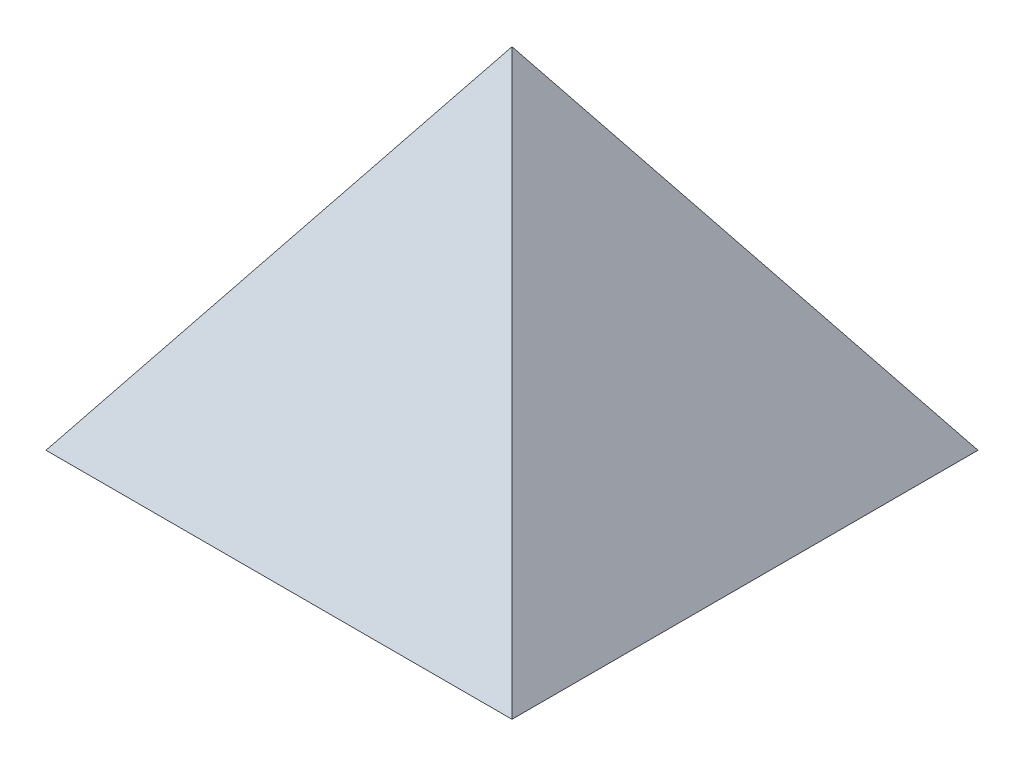
ISO-10303-21;
HEADER;
FILE_DESCRIPTION(('STEP AP214'),'2;1');
FILE_NAME('part.step','',(''),(''),'','','');
FILE_SCHEMA(('AUTOMOTIVE_DESIGN { 1 0 10303 214 1 1 1 1 }'));
ENDSEC;
DATA;
#1=APPLICATION_CONTEXT('core data for automotive mechanical design processes');
#2=APPLICATION_PROTOCOL_DEFINITION('international standard','automotive_design',2000,#1);
#3=PRODUCT_CONTEXT('',#1,'mechanical');
#4=PRODUCT('Part','Part','',(#3));
#5=PRODUCT_RELATED_PRODUCT_CATEGORY('part','',(#4));
#6=PRODUCT_DEFINITION_FORMATION('','',#4);
#7=PRODUCT_DEFINITION_CONTEXT('part definition',#1,'design');
#8=PRODUCT_DEFINITION('design','',#6,#7);
#9=PRODUCT_DEFINITION_SHAPE('','',#8);
#10=(LENGTH_UNIT() NAMED_UNIT(*) SI_UNIT(.MILLI.,.METRE.));
#11=(NAMED_UNIT(*) PLANE_ANGLE_UNIT() SI_UNIT($,.RADIAN.));
#12=(NAMED_UNIT(*) SI_UNIT($,.STERADIAN.) SOLID_ANGLE_UNIT());
#13=UNCERTAINTY_MEASURE_WITH_UNIT(LENGTH_MEASURE(1.E-05),#10,'distance_accuracy_value','');
#14=(GEOMETRIC_REPRESENTATION_CONTEXT(3) GLOBAL_UNCERTAINTY_ASSIGNED_CONTEXT((#13)) GLOBAL_UNIT_ASSIGNED_CONTEXT((#10,
#11,#12)) REPRESENTATION_CONTEXT('',''));
#15=CARTESIAN_POINT('',(0.,0.,0.));
#16=DIRECTION('',(0.,0.,1.));
#17=DIRECTION('',(1.,0.,0.));
#18=AXIS2_PLACEMENT_3D('',#15,#16,#17);
#19=CARTESIAN_POINT('',(0.,2.54,0.));
#20=DIRECTION('',(0.,-1.,0.));
#21=DIRECTION('',(0.,0.,-1.));
#22=AXIS2_PLACEMENT_3D('',#19,#20,#21);
#23=PLANE('',#22);
#24=DIRECTION('',(-1.,0.,0.));
#25=VECTOR('',#24,1.);
#26=CARTESIAN_POINT('',(0.,2.54,-46.0539665867738));
#27=LINE('',#26,#25);
#28=CARTESIAN_POINT('',(46.0539665867738,2.54,-46.0539665867738));
#29=VERTEX_POINT('',#28);
#30=CARTESIAN_POINT('',(-31.5228230502122,2.54000000000002,-46.0539665867738));
#31=VERTEX_POINT('',#30);
#32=EDGE_CURVE('E119',#29,#31,#27,.T.);
#33=ORIENTED_EDGE('',*,*,#32,.T.);
#34=CARTESIAN_POINT('',(-39.3939769497878,2.54000000000002,-46.0539665867738));
#35=VERTEX_POINT('',#34);
#36=EDGE_CURVE('E109',#31,#35,#27,.T.);
#37=ORIENTED_EDGE('',*,*,#36,.T.);
#38=CARTESIAN_POINT('',(-46.0539665867738,2.54,-46.0539665867738));
#39=VERTEX_POINT('',#38);
#40=EDGE_CURVE('E110',#35,#39,#27,.T.);
#41=ORIENTED_EDGE('',*,*,#40,.T.);
#42=DIRECTION('',(0.,0.,1.));
#43=VECTOR('',#42,1.);
#44=CARTESIAN_POINT('',(-46.0539665867738,2.54,0.));
#45=LINE('',#44,#43);
#46=CARTESIAN_POINT('',(-46.0539665867738,2.54,46.0539665867738));
#47=VERTEX_POINT('',#46);
#48=EDGE_CURVE('E123',#39,#47,#45,.T.);
#49=ORIENTED_EDGE('',*,*,#48,.T.);
#50=DIRECTION('',(1.,0.,0.));
#51=VECTOR('',#50,1.);
#52=CARTESIAN_POINT('',(0.,2.54,46.0539665867738));
#53=LINE('',#52,#51);
#54=CARTESIAN_POINT('',(46.0539665867738,2.54,46.0539665867738));
#55=VERTEX_POINT('',#54);
#56=EDGE_CURVE('E66',#47,#55,#53,.T.);
#57=ORIENTED_EDGE('',*,*,#56,.T.);
#58=DIRECTION('',(0.,0.,-1.));
#59=VECTOR('',#58,1.);
#60=CARTESIAN_POINT('',(46.0539665867738,2.54,0.));
#61=LINE('',#60,#59);
#62=EDGE_CURVE('E12',#55,#29,#61,.T.);
#63=ORIENTED_EDGE('',*,*,#62,.T.);
#64=EDGE_LOOP('',(#33,#37,#41,#49,#57,#63));
#65=FACE_BOUND('',#64,.T.);
#66=ADVANCED_FACE('F43',(#65),#23,.F.);
#67=CARTESIAN_POINT('',(33.0558230216126,22.0372153477418,0.));
#68=DIRECTION('',(0.832050294337844,0.554700196225229,0.));
#69=DIRECTION('',(-0.554700196225229,0.832050294337844,0.));
#70=AXIS2_PLACEMENT_3D('',#67,#68,#69);
#71=PLANE('',#70);
#72=ORIENTED_EDGE('',*,*,#62,.F.);
#73=DIRECTION('',(0.485071250072666,-0.727606875108999,0.485071250072666));
#74=VECTOR('',#73,1.);
#75=CARTESIAN_POINT('',(25.277982310645,33.7039764141933,25.277982310645));
#76=LINE('',#75,#74);
#77=CARTESIAN_POINT('',(0.,71.6209498801607,0.));
#78=VERTEX_POINT('',#77);
#79=EDGE_CURVE('E129',#78,#55,#76,.T.);
#80=ORIENTED_EDGE('',*,*,#79,.F.);
#81=DIRECTION('',(0.485071250072666,-0.727606875108999,-0.485071250072666));
#82=VECTOR('',#81,1.);
#83=CARTESIAN_POINT('',(25.277982310645,33.7039764141933,-25.277982310645));
#84=LINE('',#83,#82);
#85=EDGE_CURVE('E128',#78,#29,#84,.T.);
#86=ORIENTED_EDGE('',*,*,#85,.T.);
#87=EDGE_LOOP('',(#72,#80,#86));
#88=FACE_BOUND('',#87,.T.);
#89=ADVANCED_FACE('F217',(#88),#71,.F.);
#90=CARTESIAN_POINT('',(0.,22.0372153477418,-33.0558230216126));
#91=DIRECTION('',(0.,0.554700196225229,-0.832050294337844));
#92=DIRECTION('',(0.,0.832050294337844,0.554700196225229));
#93=AXIS2_PLACEMENT_3D('',#90,#91,#92);
#94=PLANE('',#93);
#95=ORIENTED_EDGE('',*,*,#40,.F.);
#96=CARTESIAN_POINT('',(-35.4584,5.98798861825136,-43.7553075079396));
#97=DIRECTION('',(0.,0.554700196225229,-0.832050294337844));
#98=DIRECTION('',(0.,0.832050294337844,0.554700196225229));
#99=AXIS2_PLACEMENT_3D('',#96,#97,#98);
#100=CIRCLE('',#99,5.71499999999992);
#101=EDGE_CURVE('E97',#35,#31,#100,.T.);
#102=ORIENTED_EDGE('',*,*,#101,.T.);
#103=ORIENTED_EDGE('',*,*,#32,.F.);
#104=ORIENTED_EDGE('',*,*,#85,.F.);
#105=DIRECTION('',(-0.485071250072666,-0.727606875108999,-0.485071250072666));
#106=VECTOR('',#105,1.);
#107=CARTESIAN_POINT('',(-25.277982310645,33.7039764141933,-25.277982310645));
#108=LINE('',#107,#106);
#109=EDGE_CURVE('E114',#78,#39,#108,.T.);
#110=ORIENTED_EDGE('',*,*,#109,.T.);
#111=EDGE_LOOP('',(#95,#102,#103,#104,#110));
#112=FACE_BOUND('',#111,.T.);
#113=ADVANCED_FACE('F112',(#112),#94,.F.);
#114=CARTESIAN_POINT('',(0.,22.0372153477418,33.0558230216126));
#115=DIRECTION('',(0.,0.554700196225229,0.832050294337844));
#116=DIRECTION('',(0.,-0.832050294337844,0.554700196225229));
#117=AXIS2_PLACEMENT_3D('',#114,#115,#116);
#118=PLANE('',#117);
#119=ORIENTED_EDGE('',*,*,#56,.F.);
#120=DIRECTION('',(-0.485071250072666,-0.727606875108999,0.485071250072666));
#121=VECTOR('',#120,1.);
#122=CARTESIAN_POINT('',(-25.277982310645,33.7039764141933,25.277982310645));
#123=LINE('',#122,#121);
#124=EDGE_CURVE('E126',#78,#47,#123,.T.);
#125=ORIENTED_EDGE('',*,*,#124,.F.);
#126=ORIENTED_EDGE('',*,*,#79,.T.);
#127=EDGE_LOOP('',(#119,#125,#126));
#128=FACE_BOUND('',#127,.T.);
#129=ADVANCED_FACE('F279',(#128),#118,.F.);
#130=CARTESIAN_POINT('',(-33.0558230216126,22.0372153477418,0.));
#131=DIRECTION('',(-0.832050294337844,0.554700196225229,0.));
#132=DIRECTION('',(-0.554700196225229,-0.832050294337844,0.));
#133=AXIS2_PLACEMENT_3D('',#130,#131,#132);
#134=PLANE('',#133);
#135=ORIENTED_EDGE('',*,*,#48,.F.);
#136=ORIENTED_EDGE('',*,*,#109,.F.);
#137=ORIENTED_EDGE('',*,*,#124,.T.);
#138=EDGE_LOOP('',(#135,#136,#137));
#139=FACE_BOUND('',#138,.T.);
#140=ADVANCED_FACE('F276',(#139),#134,.F.);
#141=CARTESIAN_POINT('',(-35.4584,5.98798861825136,-43.7553075079396));
#142=DIRECTION('',(0.,0.554700196225229,-0.832050294337844));
#143=DIRECTION('',(0.,0.832050294337844,0.554700196225229));
#144=AXIS2_PLACEMENT_3D('',#141,#142,#143);
#145=CYLINDRICAL_SURFACE('',#144,5.71499999999992);
#146=EDGE_CURVE('E58',#31,#35,#100,.T.);
#147=ORIENTED_EDGE('',*,*,#146,.F.);
#148=ORIENTED_EDGE('',*,*,#101,.F.);
#149=EDGE_LOOP('',(#147,#148));
#150=FACE_BOUND('',#149,.T.);
#151=CARTESIAN_POINT('',(-35.4584,7.39692711666344,-45.8687152555577));
#152=DIRECTION('',(0.,0.554700196225229,-0.832050294337844));
#153=DIRECTION('',(0.,0.832050294337844,0.554700196225229));
#154=AXIS2_PLACEMENT_3D('',#151,#152,#153);
#155=CIRCLE('',#154,5.71499999999992);
#156=CARTESIAN_POINT('',(-35.4584,12.1520945488042,-42.6986036341306));
#157=VERTEX_POINT('',#156);
#158=EDGE_CURVE('E104',#157,#157,#155,.T.);
#159=ORIENTED_EDGE('',*,*,#158,.T.);
#160=EDGE_LOOP('',(#159));
#161=FACE_BOUND('',#160,.T.);
#162=ADVANCED_FACE('F98',(#150,#161),#145,.F.);
#163=CARTESIAN_POINT('',(-35.4584,5.98798861825136,-43.7553075079396));
#164=DIRECTION('',(0.,0.554700196225229,-0.832050294337844));
#165=DIRECTION('',(0.,0.832050294337844,0.554700196225229));
#166=AXIS2_PLACEMENT_3D('',#163,#164,#165);
#167=PLANE('',#166);
#168=ORIENTED_EDGE('',*,*,#146,.T.);
#169=ORIENTED_EDGE('',*,*,#36,.F.);
#170=EDGE_LOOP('',(#168,#169));
#171=FACE_BOUND('',#170,.T.);
#172=ADVANCED_FACE('F107',(#171),#167,.T.);
#173=CARTESIAN_POINT('',(0.,0.,0.));
#174=DIRECTION('',(0.,-1.,0.));
#175=DIRECTION('',(0.,0.,-1.));
#176=AXIS2_PLACEMENT_3D('',#173,#174,#175);
#177=PLANE('',#176);
#178=DIRECTION('',(0.,0.,-1.));
#179=VECTOR('',#178,1.);
#180=CARTESIAN_POINT('',(50.8,0.,50.8));
#181=LINE('',#180,#179);
#182=CARTESIAN_POINT('',(50.8,0.,50.8));
#183=VERTEX_POINT('',#182);
#184=CARTESIAN_POINT('',(50.8,0.,-50.8));
#185=VERTEX_POINT('',#184);
#186=EDGE_CURVE('E131',#183,#185,#181,.T.);
#187=ORIENTED_EDGE('',*,*,#186,.F.);
#188=DIRECTION('',(1.,0.,0.));
#189=VECTOR('',#188,1.);
#190=CARTESIAN_POINT('',(-50.8,0.,50.8));
#191=LINE('',#190,#189);
#192=CARTESIAN_POINT('',(-50.8,0.,50.8));
#193=VERTEX_POINT('',#192);
#194=EDGE_CURVE('E138',#193,#183,#191,.T.);
#195=ORIENTED_EDGE('',*,*,#194,.F.);
#196=DIRECTION('',(0.,0.,1.));
#197=VECTOR('',#196,1.);
#198=CARTESIAN_POINT('',(-50.8,0.,50.8));
#199=LINE('',#198,#197);
#200=CARTESIAN_POINT('',(-50.8,0.,-50.8));
#201=VERTEX_POINT('',#200);
#202=EDGE_CURVE('E197',#201,#193,#199,.T.);
#203=ORIENTED_EDGE('',*,*,#202,.F.);
#204=DIRECTION('',(-1.,0.,0.));
#205=VECTOR('',#204,1.);
#206=CARTESIAN_POINT('',(-50.8,0.,-50.8));
#207=LINE('',#206,#205);
#208=EDGE_CURVE('E230',#185,#201,#207,.T.);
#209=ORIENTED_EDGE('',*,*,#208,.F.);
#210=EDGE_LOOP('',(#187,#195,#203,#209));
#211=FACE_BOUND('',#210,.T.);
#212=ADVANCED_FACE('F208',(#211),#177,.T.);
#213=CARTESIAN_POINT('',(-35.1692307692308,23.4461538461538,0.));
#214=DIRECTION('',(-0.832050294337844,0.554700196225229,0.));
#215=DIRECTION('',(-0.554700196225229,-0.832050294337844,0.));
#216=AXIS2_PLACEMENT_3D('',#213,#214,#215);
#217=PLANE('',#216);
#218=DIRECTION('',(-0.485071250072666,-0.727606875108999,-0.485071250072666));
#219=VECTOR('',#218,1.);
#220=CARTESIAN_POINT('',(0.,76.2,0.));
#221=LINE('',#220,#219);
#222=CARTESIAN_POINT('',(0.,76.2,0.));
#223=VERTEX_POINT('',#222);
#224=EDGE_CURVE('E196',#223,#201,#221,.T.);
#225=ORIENTED_EDGE('',*,*,#224,.T.);
#226=ORIENTED_EDGE('',*,*,#202,.T.);
#227=DIRECTION('',(-0.485071250072666,-0.727606875108999,0.485071250072666));
#228=VECTOR('',#227,1.);
#229=CARTESIAN_POINT('',(0.,76.2,0.));
#230=LINE('',#229,#228);
#231=EDGE_CURVE('E144',#223,#193,#230,.T.);
#232=ORIENTED_EDGE('',*,*,#231,.F.);
#233=EDGE_LOOP('',(#225,#226,#232));
#234=FACE_BOUND('',#233,.T.);
#235=ADVANCED_FACE('F156',(#234),#217,.T.);
#236=CARTESIAN_POINT('',(0.,23.4461538461538,35.1692307692308));
#237=DIRECTION('',(0.,0.554700196225229,0.832050294337844));
#238=DIRECTION('',(0.,-0.832050294337844,0.554700196225229));
#239=AXIS2_PLACEMENT_3D('',#236,#237,#238);
#240=PLANE('',#239);
#241=ORIENTED_EDGE('',*,*,#231,.T.);
#242=ORIENTED_EDGE('',*,*,#194,.T.);
#243=DIRECTION('',(0.485071250072666,-0.727606875108999,0.485071250072666));
#244=VECTOR('',#243,1.);
#245=CARTESIAN_POINT('',(0.,76.2,0.));
#246=LINE('',#245,#244);
#247=EDGE_CURVE('E52',#223,#183,#246,.T.);
#248=ORIENTED_EDGE('',*,*,#247,.F.);
#249=EDGE_LOOP('',(#241,#242,#248));
#250=FACE_BOUND('',#249,.T.);
#251=ADVANCED_FACE('F146',(#250),#240,.T.);
#252=CARTESIAN_POINT('',(0.,23.4461538461538,-35.1692307692308));
#253=DIRECTION('',(0.,0.554700196225229,-0.832050294337844));
#254=DIRECTION('',(0.,0.832050294337844,0.554700196225229));
#255=AXIS2_PLACEMENT_3D('',#252,#253,#254);
#256=PLANE('',#255);
#257=ORIENTED_EDGE('',*,*,#158,.F.);
#258=EDGE_LOOP('',(#257));
#259=FACE_BOUND('',#258,.T.);
#260=DIRECTION('',(0.485071250072666,-0.727606875108999,-0.485071250072666));
#261=VECTOR('',#260,1.);
#262=CARTESIAN_POINT('',(0.,76.2,0.));
#263=LINE('',#262,#261);
#264=EDGE_CURVE('E169',#223,#185,#263,.T.);
#265=ORIENTED_EDGE('',*,*,#264,.T.);
#266=ORIENTED_EDGE('',*,*,#208,.T.);
#267=ORIENTED_EDGE('',*,*,#224,.F.);
#268=EDGE_LOOP('',(#265,#266,#267));
#269=FACE_BOUND('',#268,.T.);
#270=ADVANCED_FACE('F155',(#259,#269),#256,.T.);
#271=CARTESIAN_POINT('',(35.1692307692308,23.4461538461538,0.));
#272=DIRECTION('',(0.832050294337844,0.554700196225229,0.));
#273=DIRECTION('',(-0.554700196225229,0.832050294337844,0.));
#274=AXIS2_PLACEMENT_3D('',#271,#272,#273);
#275=PLANE('',#274);
#276=ORIENTED_EDGE('',*,*,#247,.T.);
#277=ORIENTED_EDGE('',*,*,#186,.T.);
#278=ORIENTED_EDGE('',*,*,#264,.F.);
#279=EDGE_LOOP('',(#276,#277,#278));
#280=FACE_BOUND('',#279,.T.);
#281=ADVANCED_FACE('F45',(#280),#275,.T.);
#282=CLOSED_SHELL('',(#66,#89,#113,#129,#140,#162,#172,#212,#235,#251,#270,#281));
#283=MANIFOLD_SOLID_BREP('B2',#282);
#284=ADVANCED_BREP_SHAPE_REPRESENTATION('',(#18,#283),#14);
#285=SHAPE_DEFINITION_REPRESENTATION(#9,#284);
ENDSEC;
END-ISO-10303-21;
